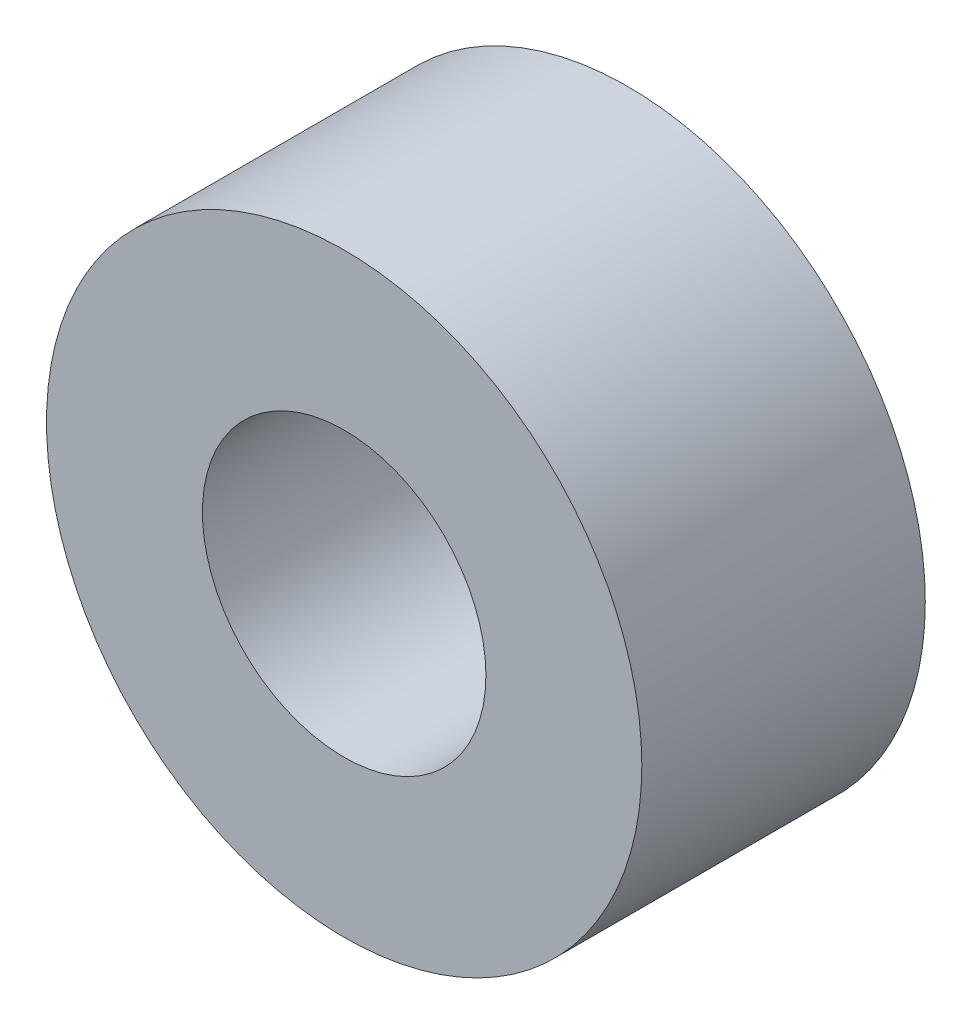
ISO-10303-21;
HEADER;
FILE_DESCRIPTION(('STEP AP214'),'2;1');
FILE_NAME('part.step','',(''),(''),'','','');
FILE_SCHEMA(('AUTOMOTIVE_DESIGN { 1 0 10303 214 1 1 1 1 }'));
ENDSEC;
DATA;
#1=APPLICATION_CONTEXT('core data for automotive mechanical design processes');
#2=APPLICATION_PROTOCOL_DEFINITION('international standard','automotive_design',2000,#1);
#3=PRODUCT_CONTEXT('',#1,'mechanical');
#4=PRODUCT('Part','Part','',(#3));
#5=PRODUCT_RELATED_PRODUCT_CATEGORY('part','',(#4));
#6=PRODUCT_DEFINITION_FORMATION('','',#4);
#7=PRODUCT_DEFINITION_CONTEXT('part definition',#1,'design');
#8=PRODUCT_DEFINITION('design','',#6,#7);
#9=PRODUCT_DEFINITION_SHAPE('','',#8);
#10=(LENGTH_UNIT() NAMED_UNIT(*) SI_UNIT(.MILLI.,.METRE.));
#11=(NAMED_UNIT(*) PLANE_ANGLE_UNIT() SI_UNIT($,.RADIAN.));
#12=(NAMED_UNIT(*) SI_UNIT($,.STERADIAN.) SOLID_ANGLE_UNIT());
#13=UNCERTAINTY_MEASURE_WITH_UNIT(LENGTH_MEASURE(1.E-05),#10,'distance_accuracy_value','');
#14=(GEOMETRIC_REPRESENTATION_CONTEXT(3) GLOBAL_UNCERTAINTY_ASSIGNED_CONTEXT((#13)) GLOBAL_UNIT_ASSIGNED_CONTEXT((#10,
#11,#12)) REPRESENTATION_CONTEXT('',''));
#15=CARTESIAN_POINT('',(0.,0.,0.));
#16=DIRECTION('',(0.,0.,1.));
#17=DIRECTION('',(1.,0.,0.));
#18=AXIS2_PLACEMENT_3D('',#15,#16,#17);
#19=CARTESIAN_POINT('',(0.,0.,10.));
#20=DIRECTION('',(0.,0.,1.));
#21=DIRECTION('',(1.,0.,0.));
#22=AXIS2_PLACEMENT_3D('',#19,#20,#21);
#23=PLANE('',#22);
#24=CARTESIAN_POINT('',(0.,0.,10.));
#25=DIRECTION('',(0.,0.,1.));
#26=DIRECTION('',(1.,0.,0.));
#27=AXIS2_PLACEMENT_3D('',#24,#25,#26);
#28=CIRCLE('',#27,10.5);
#29=CARTESIAN_POINT('',(10.5,0.,10.));
#30=VERTEX_POINT('',#29);
#31=EDGE_CURVE('E10',#30,#30,#28,.T.);
#32=ORIENTED_EDGE('',*,*,#31,.T.);
#33=EDGE_LOOP('',(#32));
#34=FACE_BOUND('',#33,.T.);
#35=CARTESIAN_POINT('',(0.,0.,10.));
#36=DIRECTION('',(0.,0.,1.));
#37=DIRECTION('',(1.,0.,0.));
#38=AXIS2_PLACEMENT_3D('',#35,#36,#37);
#39=CIRCLE('',#38,5.);
#40=CARTESIAN_POINT('',(5.,0.,10.));
#41=VERTEX_POINT('',#40);
#42=EDGE_CURVE('E43',#41,#41,#39,.T.);
#43=ORIENTED_EDGE('',*,*,#42,.F.);
#44=EDGE_LOOP('',(#43));
#45=FACE_BOUND('',#44,.T.);
#46=ADVANCED_FACE('F32',(#34,#45),#23,.T.);
#47=CARTESIAN_POINT('',(0.,0.,0.));
#48=DIRECTION('',(0.,0.,1.));
#49=DIRECTION('',(1.,0.,0.));
#50=AXIS2_PLACEMENT_3D('',#47,#48,#49);
#51=PLANE('',#50);
#52=CARTESIAN_POINT('',(0.,0.,0.));
#53=DIRECTION('',(0.,0.,1.));
#54=DIRECTION('',(1.,0.,0.));
#55=AXIS2_PLACEMENT_3D('',#52,#53,#54);
#56=CIRCLE('',#55,10.5);
#57=CARTESIAN_POINT('',(10.5,0.,0.));
#58=VERTEX_POINT('',#57);
#59=EDGE_CURVE('E36',#58,#58,#56,.T.);
#60=ORIENTED_EDGE('',*,*,#59,.F.);
#61=EDGE_LOOP('',(#60));
#62=FACE_BOUND('',#61,.T.);
#63=CARTESIAN_POINT('',(0.,0.,0.));
#64=DIRECTION('',(0.,0.,1.));
#65=DIRECTION('',(1.,0.,0.));
#66=AXIS2_PLACEMENT_3D('',#63,#64,#65);
#67=CIRCLE('',#66,5.);
#68=CARTESIAN_POINT('',(5.,0.,0.));
#69=VERTEX_POINT('',#68);
#70=EDGE_CURVE('E45',#69,#69,#67,.T.);
#71=ORIENTED_EDGE('',*,*,#70,.T.);
#72=EDGE_LOOP('',(#71));
#73=FACE_BOUND('',#72,.T.);
#74=ADVANCED_FACE('F55',(#62,#73),#51,.F.);
#75=CARTESIAN_POINT('',(0.,0.,10.));
#76=DIRECTION('',(0.,0.,-1.));
#77=DIRECTION('',(-1.,0.,0.));
#78=AXIS2_PLACEMENT_3D('',#75,#76,#77);
#79=CYLINDRICAL_SURFACE('',#78,10.5);
#80=ORIENTED_EDGE('',*,*,#31,.F.);
#81=EDGE_LOOP('',(#80));
#82=FACE_BOUND('',#81,.T.);
#83=ORIENTED_EDGE('',*,*,#59,.T.);
#84=EDGE_LOOP('',(#83));
#85=FACE_BOUND('',#84,.T.);
#86=ADVANCED_FACE('F34',(#82,#85),#79,.T.);
#87=CARTESIAN_POINT('',(0.,0.,10.));
#88=DIRECTION('',(0.,0.,-1.));
#89=DIRECTION('',(-1.,0.,0.));
#90=AXIS2_PLACEMENT_3D('',#87,#88,#89);
#91=CYLINDRICAL_SURFACE('',#90,5.);
#92=ORIENTED_EDGE('',*,*,#42,.T.);
#93=EDGE_LOOP('',(#92));
#94=FACE_BOUND('',#93,.T.);
#95=ORIENTED_EDGE('',*,*,#70,.F.);
#96=EDGE_LOOP('',(#95));
#97=FACE_BOUND('',#96,.T.);
#98=ADVANCED_FACE('F51',(#94,#97),#91,.F.);
#99=CLOSED_SHELL('',(#46,#74,#86,#98));
#100=MANIFOLD_SOLID_BREP('B2',#99);
#101=ADVANCED_BREP_SHAPE_REPRESENTATION('',(#18,#100),#14);
#102=SHAPE_DEFINITION_REPRESENTATION(#9,#101);
ENDSEC;
END-ISO-10303-21;
